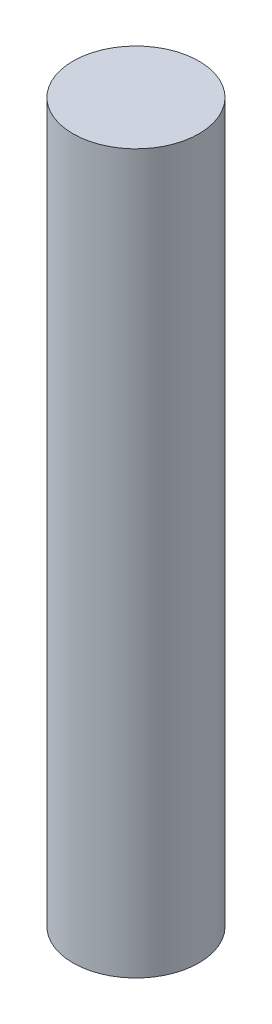
ISO-10303-21;
HEADER;
FILE_DESCRIPTION(('STEP AP214'),'2;1');
FILE_NAME('part.step','',(''),(''),'','','');
FILE_SCHEMA(('AUTOMOTIVE_DESIGN { 1 0 10303 214 1 1 1 1 }'));
ENDSEC;
DATA;
#1=APPLICATION_CONTEXT('core data for automotive mechanical design processes');
#2=APPLICATION_PROTOCOL_DEFINITION('international standard','automotive_design',2000,#1);
#3=PRODUCT_CONTEXT('',#1,'mechanical');
#4=PRODUCT('Part','Part','',(#3));
#5=PRODUCT_RELATED_PRODUCT_CATEGORY('part','',(#4));
#6=PRODUCT_DEFINITION_FORMATION('','',#4);
#7=PRODUCT_DEFINITION_CONTEXT('part definition',#1,'design');
#8=PRODUCT_DEFINITION('design','',#6,#7);
#9=PRODUCT_DEFINITION_SHAPE('','',#8);
#10=(LENGTH_UNIT() NAMED_UNIT(*) SI_UNIT(.MILLI.,.METRE.));
#11=(NAMED_UNIT(*) PLANE_ANGLE_UNIT() SI_UNIT($,.RADIAN.));
#12=(NAMED_UNIT(*) SI_UNIT($,.STERADIAN.) SOLID_ANGLE_UNIT());
#13=UNCERTAINTY_MEASURE_WITH_UNIT(LENGTH_MEASURE(1.E-05),#10,'distance_accuracy_value','');
#14=(GEOMETRIC_REPRESENTATION_CONTEXT(3) GLOBAL_UNCERTAINTY_ASSIGNED_CONTEXT((#13)) GLOBAL_UNIT_ASSIGNED_CONTEXT((#10,
#11,#12)) REPRESENTATION_CONTEXT('',''));
#15=CARTESIAN_POINT('',(0.,0.,0.));
#16=DIRECTION('',(0.,0.,1.));
#17=DIRECTION('',(1.,0.,0.));
#18=AXIS2_PLACEMENT_3D('',#15,#16,#17);
#19=CARTESIAN_POINT('',(0.,57.,0.));
#20=DIRECTION('',(0.,-1.,0.));
#21=DIRECTION('',(0.,0.,-1.));
#22=AXIS2_PLACEMENT_3D('',#19,#20,#21);
#23=CYLINDRICAL_SURFACE('',#22,5.);
#24=CARTESIAN_POINT('',(0.,57.,0.));
#25=DIRECTION('',(0.,1.,0.));
#26=DIRECTION('',(0.,0.,1.));
#27=AXIS2_PLACEMENT_3D('',#24,#25,#26);
#28=CIRCLE('',#27,5.);
#29=CARTESIAN_POINT('',(0.,57.,5.));
#30=VERTEX_POINT('',#29);
#31=EDGE_CURVE('E10',#30,#30,#28,.T.);
#32=ORIENTED_EDGE('',*,*,#31,.F.);
#33=EDGE_LOOP('',(#32));
#34=FACE_BOUND('',#33,.T.);
#35=CARTESIAN_POINT('',(0.,0.,0.));
#36=DIRECTION('',(0.,1.,0.));
#37=DIRECTION('',(0.,0.,1.));
#38=AXIS2_PLACEMENT_3D('',#35,#36,#37);
#39=CIRCLE('',#38,5.);
#40=CARTESIAN_POINT('',(0.,0.,5.));
#41=VERTEX_POINT('',#40);
#42=EDGE_CURVE('E33',#41,#41,#39,.T.);
#43=ORIENTED_EDGE('',*,*,#42,.T.);
#44=EDGE_LOOP('',(#43));
#45=FACE_BOUND('',#44,.T.);
#46=ADVANCED_FACE('F30',(#34,#45),#23,.T.);
#47=CARTESIAN_POINT('',(0.,57.,0.));
#48=DIRECTION('',(0.,1.,0.));
#49=DIRECTION('',(0.,0.,1.));
#50=AXIS2_PLACEMENT_3D('',#47,#48,#49);
#51=PLANE('',#50);
#52=ORIENTED_EDGE('',*,*,#31,.T.);
#53=EDGE_LOOP('',(#52));
#54=FACE_BOUND('',#53,.T.);
#55=ADVANCED_FACE('F45',(#54),#51,.T.);
#56=CARTESIAN_POINT('',(0.,0.,0.));
#57=DIRECTION('',(0.,1.,0.));
#58=DIRECTION('',(0.,0.,1.));
#59=AXIS2_PLACEMENT_3D('',#56,#57,#58);
#60=PLANE('',#59);
#61=ORIENTED_EDGE('',*,*,#42,.F.);
#62=EDGE_LOOP('',(#61));
#63=FACE_BOUND('',#62,.T.);
#64=ADVANCED_FACE('F43',(#63),#60,.F.);
#65=CLOSED_SHELL('',(#46,#55,#64));
#66=MANIFOLD_SOLID_BREP('B2',#65);
#67=ADVANCED_BREP_SHAPE_REPRESENTATION('',(#18,#66),#14);
#68=SHAPE_DEFINITION_REPRESENTATION(#9,#67);
ENDSEC;
END-ISO-10303-21;
